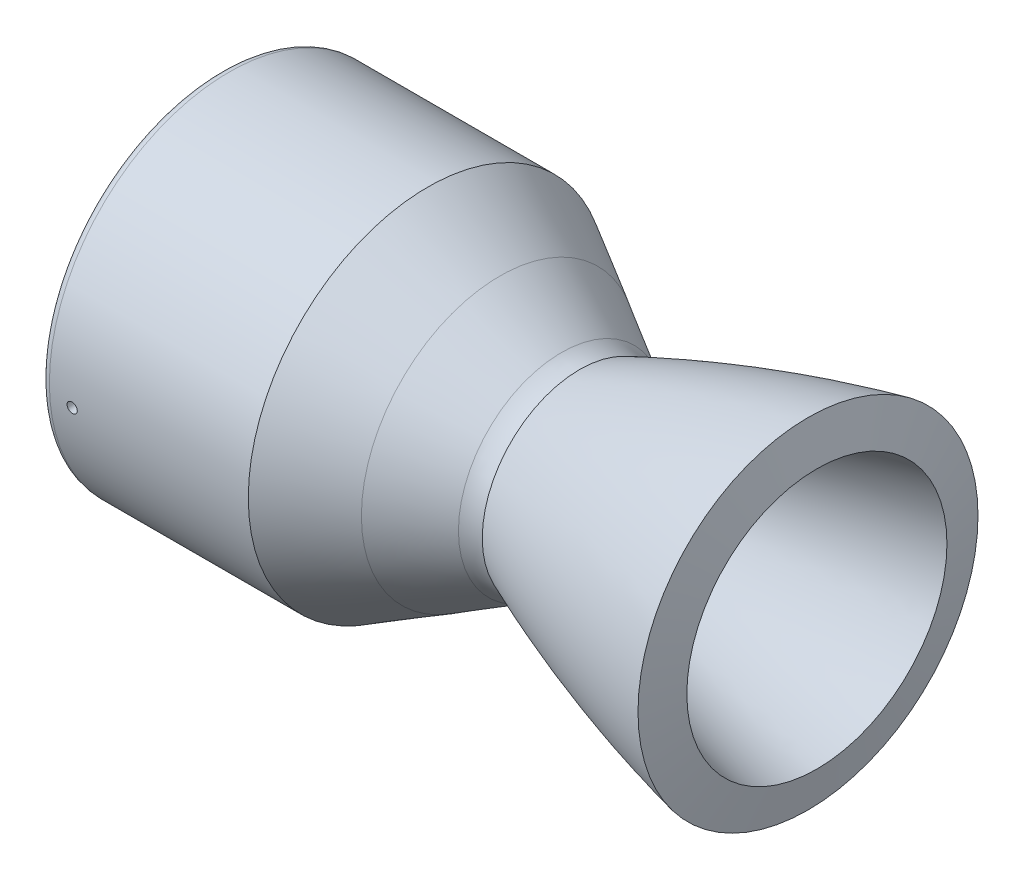
ISO-10303-21;
HEADER;
FILE_DESCRIPTION(('STEP AP214'),'2;1');
FILE_NAME('part.step','',(''),(''),'','','');
FILE_SCHEMA(('AUTOMOTIVE_DESIGN { 1 0 10303 214 1 1 1 1 }'));
ENDSEC;
DATA;
#1=APPLICATION_CONTEXT('core data for automotive mechanical design processes');
#2=APPLICATION_PROTOCOL_DEFINITION('international standard','automotive_design',2000,#1);
#3=PRODUCT_CONTEXT('',#1,'mechanical');
#4=PRODUCT('Part','Part','',(#3));
#5=PRODUCT_RELATED_PRODUCT_CATEGORY('part','',(#4));
#6=PRODUCT_DEFINITION_FORMATION('','',#4);
#7=PRODUCT_DEFINITION_CONTEXT('part definition',#1,'design');
#8=PRODUCT_DEFINITION('design','',#6,#7);
#9=PRODUCT_DEFINITION_SHAPE('','',#8);
#10=(LENGTH_UNIT() NAMED_UNIT(*) SI_UNIT(.MILLI.,.METRE.));
#11=(NAMED_UNIT(*) PLANE_ANGLE_UNIT() SI_UNIT($,.RADIAN.));
#12=(NAMED_UNIT(*) SI_UNIT($,.STERADIAN.) SOLID_ANGLE_UNIT());
#13=UNCERTAINTY_MEASURE_WITH_UNIT(LENGTH_MEASURE(1.E-05),#10,'distance_accuracy_value','');
#14=(GEOMETRIC_REPRESENTATION_CONTEXT(3) GLOBAL_UNCERTAINTY_ASSIGNED_CONTEXT((#13)) GLOBAL_UNIT_ASSIGNED_CONTEXT((#10,
#11,#12)) REPRESENTATION_CONTEXT('',''));
#15=CARTESIAN_POINT('',(0.,0.,0.));
#16=DIRECTION('',(0.,0.,1.));
#17=DIRECTION('',(1.,0.,0.));
#18=AXIS2_PLACEMENT_3D('',#15,#16,#17);
#19=CARTESIAN_POINT('',(2.54181884933777,17.9961231089638,0.));
#20=CARTESIAN_POINT('',(36.7084102,32.3929756,0.));
#21=CARTESIAN_POINT('',(72.4744296,40.360473,0.));
#22=B_SPLINE_CURVE_WITH_KNOTS('',2,(#19,#20,#21),.UNSPECIFIED.,.F.,.F.,(3,3),(0.,1.),.UNSPECIFIED.);
#23=CARTESIAN_POINT('',(-112.522,0.,0.));
#24=DIRECTION('',(-1.,0.,0.));
#25=AXIS1_PLACEMENT('',#23,#24);
#26=SURFACE_OF_REVOLUTION('',#22,#25);
#27=CARTESIAN_POINT('',(72.4744296,0.,0.));
#28=DIRECTION('',(-1.,0.,0.));
#29=DIRECTION('',(0.,0.,1.));
#30=AXIS2_PLACEMENT_3D('',#27,#28,#29);
#31=CIRCLE('',#30,40.360473);
#32=CARTESIAN_POINT('',(72.4744296,0.,40.360473));
#33=VERTEX_POINT('',#32);
#34=EDGE_CURVE('E79',#33,#33,#31,.T.);
#35=ORIENTED_EDGE('',*,*,#34,.F.);
#36=EDGE_LOOP('',(#35));
#37=FACE_BOUND('',#36,.T.);
#38=CARTESIAN_POINT('',(2.54181884933777,0.,0.));
#39=DIRECTION('',(-1.,0.,0.));
#40=DIRECTION('',(0.,0.,1.));
#41=AXIS2_PLACEMENT_3D('',#38,#39,#40);
#42=CIRCLE('',#41,17.9961231089638);
#43=CARTESIAN_POINT('',(2.54181884933777,0.,17.9961231089638));
#44=VERTEX_POINT('',#43);
#45=EDGE_CURVE('E121',#44,#44,#42,.T.);
#46=ORIENTED_EDGE('',*,*,#45,.T.);
#47=EDGE_LOOP('',(#46));
#48=FACE_BOUND('',#47,.T.);
#49=ADVANCED_FACE('F39',(#37,#48),#26,.T.);
#50=CARTESIAN_POINT('',(72.4744296,0.,0.));
#51=DIRECTION('',(-1.,0.,0.));
#52=DIRECTION('',(0.,0.,1.));
#53=AXIS2_PLACEMENT_3D('',#50,#51,#52);
#54=CONICAL_SURFACE('',#53,40.360473,1.3516080717549);
#55=CARTESIAN_POINT('',(69.7129749828024,0.,0.));
#56=DIRECTION('',(-1.,0.,0.));
#57=DIRECTION('',(0.,0.,1.));
#58=AXIS2_PLACEMENT_3D('',#55,#56,#57);
#59=CIRCLE('',#58,52.7566162872147);
#60=CARTESIAN_POINT('',(69.7129749828024,0.,52.7566162872147));
#61=VERTEX_POINT('',#60);
#62=EDGE_CURVE('E83',#61,#61,#59,.T.);
#63=ORIENTED_EDGE('',*,*,#62,.F.);
#64=EDGE_LOOP('',(#63));
#65=FACE_BOUND('',#64,.T.);
#66=ORIENTED_EDGE('',*,*,#34,.T.);
#67=EDGE_LOOP('',(#66));
#68=FACE_BOUND('',#67,.T.);
#69=ADVANCED_FACE('F142',(#65,#68),#54,.T.);
#70=CARTESIAN_POINT('',(69.7129749828024,52.7566162872147,0.));
#71=CARTESIAN_POINT('',(57.6343477080184,50.0658938355177,0.));
#72=CARTESIAN_POINT('',(39.7050398462939,45.2263831834167,0.));
#73=CARTESIAN_POINT('',(16.2272037398131,37.1845855209253,0.));
#74=CARTESIAN_POINT('',(4.59605992113903,32.6199854330453,0.));
#75=CARTESIAN_POINT('',(-1.15654760217802,30.2169193227736,0.));
#76=B_SPLINE_CURVE_WITH_KNOTS('',3,(#70,#71,#72,#73,#74,#75),.UNSPECIFIED.,.F.,.F.,(4,1,1,4),
(0.0175086981395631,0.508754349069782,0.754377174534891,1.),.UNSPECIFIED.);
#77=CARTESIAN_POINT('',(-112.522,0.,0.));
#78=DIRECTION('',(-1.,0.,0.));
#79=AXIS1_PLACEMENT('',#77,#78);
#80=SURFACE_OF_REVOLUTION('',#76,#79);
#81=CARTESIAN_POINT('',(-1.15654760217802,0.,0.));
#82=DIRECTION('',(-1.,0.,0.));
#83=DIRECTION('',(0.,0.,1.));
#84=AXIS2_PLACEMENT_3D('',#81,#82,#83);
#85=CIRCLE('',#84,30.2169193227736);
#86=CARTESIAN_POINT('',(-1.15654760217802,0.,30.2169193227736));
#87=VERTEX_POINT('',#86);
#88=EDGE_CURVE('E88',#87,#87,#85,.T.);
#89=ORIENTED_EDGE('',*,*,#88,.F.);
#90=EDGE_LOOP('',(#89));
#91=FACE_BOUND('',#90,.T.);
#92=ORIENTED_EDGE('',*,*,#62,.T.);
#93=EDGE_LOOP('',(#92));
#94=FACE_BOUND('',#93,.T.);
#95=ADVANCED_FACE('F137',(#91,#94),#80,.T.);
#96=CARTESIAN_POINT('',(-0.0623918207048905,0.,0.));
#97=DIRECTION('',(-1.,0.,0.));
#98=DIRECTION('',(0.,0.,1.));
#99=AXIS2_PLACEMENT_3D('',#96,#97,#98);
#100=TOROIDAL_SURFACE('',#99,43.6343806,13.462);
#101=CARTESIAN_POINT('',(-6.79339099490552,0.,0.));
#102=DIRECTION('',(-1.,0.,0.));
#103=DIRECTION('',(0.,0.,1.));
#104=AXIS2_PLACEMENT_3D('',#101,#102,#103);
#105=CIRCLE('',#104,31.9759461374784);
#106=CARTESIAN_POINT('',(-6.79339099490552,0.,31.9759461374784));
#107=VERTEX_POINT('',#106);
#108=EDGE_CURVE('E91',#107,#107,#105,.T.);
#109=ORIENTED_EDGE('',*,*,#108,.F.);
#110=EDGE_LOOP('',(#109));
#111=FACE_BOUND('',#110,.T.);
#112=ORIENTED_EDGE('',*,*,#88,.T.);
#113=EDGE_LOOP('',(#112));
#114=FACE_BOUND('',#113,.T.);
#115=ADVANCED_FACE('F141',(#111,#114),#100,.F.);
#116=CARTESIAN_POINT('',(-6.79339099490552,0.,0.));
#117=DIRECTION('',(-1.,0.,0.));
#118=DIRECTION('',(0.,0.,1.));
#119=AXIS2_PLACEMENT_3D('',#116,#117,#118);
#120=CONICAL_SURFACE('',#119,31.9759461374784,0.523598704765514);
#121=CARTESIAN_POINT('',(-25.8858890437624,0.,0.));
#122=DIRECTION('',(-1.,0.,0.));
#123=DIRECTION('',(0.,0.,1.));
#124=AXIS2_PLACEMENT_3D('',#121,#122,#123);
#125=CIRCLE('',#124,42.999003222322);
#126=CARTESIAN_POINT('',(-25.8858890437624,0.,42.999003222322));
#127=VERTEX_POINT('',#126);
#128=EDGE_CURVE('E94',#127,#127,#125,.T.);
#129=ORIENTED_EDGE('',*,*,#128,.F.);
#130=EDGE_LOOP('',(#129));
#131=FACE_BOUND('',#130,.T.);
#132=ORIENTED_EDGE('',*,*,#108,.T.);
#133=EDGE_LOOP('',(#132));
#134=FACE_BOUND('',#133,.T.);
#135=ADVANCED_FACE('F202',(#131,#134),#120,.T.);
#136=CARTESIAN_POINT('',(-25.8858890437624,0.,0.));
#137=DIRECTION('',(-1.,0.,0.));
#138=DIRECTION('',(0.,0.,1.));
#139=AXIS2_PLACEMENT_3D('',#136,#137,#138);
#140=CONICAL_SURFACE('',#139,42.999003222322,0.517278453908498);
#141=CARTESIAN_POINT('',(-48.2551035346729,0.,0.));
#142=DIRECTION('',(-1.,0.,0.));
#143=DIRECTION('',(0.,0.,1.));
#144=AXIS2_PLACEMENT_3D('',#141,#142,#143);
#145=CIRCLE('',#144,55.7260506);
#146=CARTESIAN_POINT('',(-48.2551035346729,0.,55.7260506));
#147=VERTEX_POINT('',#146);
#148=EDGE_CURVE('E97',#147,#147,#145,.T.);
#149=ORIENTED_EDGE('',*,*,#148,.F.);
#150=EDGE_LOOP('',(#149));
#151=FACE_BOUND('',#150,.T.);
#152=ORIENTED_EDGE('',*,*,#128,.T.);
#153=EDGE_LOOP('',(#152));
#154=FACE_BOUND('',#153,.T.);
#155=ADVANCED_FACE('F197',(#151,#154),#140,.T.);
#156=CARTESIAN_POINT('',(-112.522,0.,0.));
#157=DIRECTION('',(-1.,0.,0.));
#158=DIRECTION('',(0.,0.,1.));
#159=AXIS2_PLACEMENT_3D('',#156,#157,#158);
#160=CYLINDRICAL_SURFACE('',#159,55.7260506);
#161=CARTESIAN_POINT('',(-102.997,-4.75570963469849,55.5227515649593));
#162=CARTESIAN_POINT('',(-102.907848841245,-4.75570571091992,55.5227520944038));
#163=CARTESIAN_POINT('',(-102.818633499949,-4.74819910466635,55.5233964527416));
#164=CARTESIAN_POINT('',(-102.64266118605,-4.71835766251599,55.5259401725782));
#165=CARTESIAN_POINT('',(-102.555907281623,-4.69600510083654,55.5278410343048));
#166=CARTESIAN_POINT('',(-102.387432618566,-4.63710676169106,55.5327905362983));
#167=CARTESIAN_POINT('',(-102.305709425921,-4.60056791153285,55.5358386163449));
#168=CARTESIAN_POINT('',(-102.149598897755,-4.51433947223615,55.5429141912278));
#169=CARTESIAN_POINT('',(-102.075209774292,-4.46465309921547,55.5469414465209));
#170=CARTESIAN_POINT('',(-101.935824438661,-4.35350934806793,55.5557627192288));
#171=CARTESIAN_POINT('',(-101.870831600273,-4.29204776032168,55.5605570107564));
#172=CARTESIAN_POINT('',(-101.752112073007,-4.15909924195716,55.5706671175146));
#173=CARTESIAN_POINT('',(-101.698385832165,-4.08761191283598,55.5759829534732));
#174=CARTESIAN_POINT('',(-101.603719888269,-3.93662346556042,55.5868818372681));
#175=CARTESIAN_POINT('',(-101.562782122247,-3.8571211358072,55.5924649254368));
#176=CARTESIAN_POINT('',(-101.494867847942,-3.69236306340507,55.6036507900974));
#177=CARTESIAN_POINT('',(-101.467891286433,-3.607107342691,55.6092535665141));
#178=CARTESIAN_POINT('',(-101.428672201946,-3.43328366373305,55.6202558110541));
#179=CARTESIAN_POINT('',(-101.416425656275,-3.34471661661111,55.6256553342944));
#180=CARTESIAN_POINT('',(-101.407001849143,-3.1667622574629,55.6360699119356));
#181=CARTESIAN_POINT('',(-101.409824530807,-3.0773749485338,55.6410849677874));
#182=CARTESIAN_POINT('',(-101.430455644495,-2.9003450545727,55.6505936315528));
#183=CARTESIAN_POINT('',(-101.44825973025,-2.81270197106969,55.6550873902701));
#184=CARTESIAN_POINT('',(-101.498341537994,-2.64162315204813,55.6634699097027));
#185=CARTESIAN_POINT('',(-101.530619290167,-2.55818742530427,55.6673586691562));
#186=CARTESIAN_POINT('',(-101.60873716587,-2.39788197177976,55.6744943692619));
#187=CARTESIAN_POINT('',(-101.654579281449,-2.32101321155612,55.6777412155264));
#188=CARTESIAN_POINT('',(-101.758523103521,-2.17603979761463,55.6835957741661));
#189=CARTESIAN_POINT('',(-101.816624834791,-2.10793516161002,55.6862034852496));
#190=CARTESIAN_POINT('',(-101.943463197182,-1.98240401773155,55.6908138356517));
#191=CARTESIAN_POINT('',(-102.012203600474,-1.92498131333039,55.6928162596062));
#192=CARTESIAN_POINT('',(-102.15835470188,-1.82247946309779,55.696264891251));
#193=CARTESIAN_POINT('',(-102.235765401387,-1.77740031924852,55.697711098852));
#194=CARTESIAN_POINT('',(-102.397061805599,-1.70087104176956,55.7001007747853));
#195=CARTESIAN_POINT('',(-102.480947568371,-1.6694210303819,55.7010442386084));
#196=CARTESIAN_POINT('',(-102.65281190435,-1.6210492970047,55.7024730619283));
#197=CARTESIAN_POINT('',(-102.740790467477,-1.6041275392384,55.7029584225533));
#198=CARTESIAN_POINT('',(-102.918309858025,-1.58529963490116,55.7034974774281));
#199=CARTESIAN_POINT('',(-103.007850125344,-1.58338821155562,55.7035513233741));
#200=CARTESIAN_POINT('',(-103.185980287516,-1.59462174912932,55.7032308516674));
#201=CARTESIAN_POINT('',(-103.274570183357,-1.60776669438446,55.7028565344602));
#202=CARTESIAN_POINT('',(-103.44827012201,-1.64873366123519,55.701658936549));
#203=CARTESIAN_POINT('',(-103.533380730619,-1.67655328614688,55.7008357291574));
#204=CARTESIAN_POINT('',(-103.697723466042,-1.74607382200014,55.6986996629791));
#205=CARTESIAN_POINT('',(-103.776955582264,-1.78777475795527,55.6973868033099));
#206=CARTESIAN_POINT('',(-103.927316516112,-1.88388266856028,55.6942187764313));
#207=CARTESIAN_POINT('',(-103.998443060566,-1.93829319457518,55.6923634576091));
#208=CARTESIAN_POINT('',(-104.13055099069,-2.05826456754104,55.6880584663342));
#209=CARTESIAN_POINT('',(-104.191532352609,-2.12382544059534,55.6856087924899));
#210=CARTESIAN_POINT('',(-104.301636469136,-2.26425287417343,55.6800754670408));
#211=CARTESIAN_POINT('',(-104.35075582062,-2.33912209588437,55.676991633969));
#212=CARTESIAN_POINT('',(-104.435718316046,-2.49602164193481,55.6701782758783));
#213=CARTESIAN_POINT('',(-104.471561488336,-2.57805195098208,55.6664487522383));
#214=CARTESIAN_POINT('',(-104.528948205432,-2.74692776148564,55.658370820752));
#215=CARTESIAN_POINT('',(-104.550493956962,-2.83377251761648,55.6540225085381));
#216=CARTESIAN_POINT('',(-104.578681467065,-3.00981976214041,55.6447793321076));
#217=CARTESIAN_POINT('',(-104.585323234764,-3.09902224908984,55.6398844682257));
#218=CARTESIAN_POINT('',(-104.583513980907,-3.27721788421365,55.6296730201472));
#219=CARTESIAN_POINT('',(-104.575068324571,-3.36621109554007,55.6243565865069));
#220=CARTESIAN_POINT('',(-104.543334990671,-3.54149497398161,55.613471775757));
#221=CARTESIAN_POINT('',(-104.520047283674,-3.6277856357366,55.6079033981477));
#222=CARTESIAN_POINT('',(-104.459291581467,-3.79522023738959,55.596727106624));
#223=CARTESIAN_POINT('',(-104.421823345265,-3.87636408979175,55.5911191920392));
#224=CARTESIAN_POINT('',(-104.333772184838,-4.03120456899237,55.5801055911994));
#225=CARTESIAN_POINT('',(-104.283189738893,-4.104901467247,55.5746998975775));
#226=CARTESIAN_POINT('',(-104.170330844837,-4.2427860232008,55.5643435365902));
#227=CARTESIAN_POINT('',(-104.108051487024,-4.30697130768423,55.5593929829021));
#228=CARTESIAN_POINT('',(-103.973553110029,-4.42401193991381,55.5501961326695));
#229=CARTESIAN_POINT('',(-103.901331632541,-4.47686447721181,55.5459500108786));
#230=CARTESIAN_POINT('',(-103.748972400875,-4.5697533595135,55.5383853727452));
#231=CARTESIAN_POINT('',(-103.668829676044,-4.60978158947631,55.5350674439179));
#232=CARTESIAN_POINT('',(-103.502999604881,-4.67580700877157,55.5295475615793));
#233=CARTESIAN_POINT('',(-103.417319011371,-4.70182093853356,55.5273442767907));
#234=CARTESIAN_POINT('',(-103.275413927347,-4.7321850674311,55.5247626528832));
#235=CARTESIAN_POINT('',(-103.22011061444,-4.7409957329416,55.5240102151579));
#236=CARTESIAN_POINT('',(-103.10887996143,-4.75275924710956,55.5230045051185));
#237=CARTESIAN_POINT('',(-103.052952621493,-4.75571209732153,55.522751232672));
#238=CARTESIAN_POINT('',(-102.997,-4.75570963469849,55.5227515649593));
#239=B_SPLINE_CURVE_WITH_KNOTS('',3,(#161,#162,#163,#164,#165,#166,#167,#168,#169,#170,#171,
#172,#173,#174,#175,#176,#177,#178,#179,#180,#181,#182,#183,#184,#185,#186,#187,#188,#189,#190,
#191,#192,#193,#194,#195,#196,#197,#198,#199,#200,#201,#202,#203,#204,#205,#206,#207,#208,#209,
#210,#211,#212,#213,#214,#215,#216,#217,#218,#219,#220,#221,#222,#223,#224,#225,#226,#227,#228,
#229,#230,#231,#232,#233,#234,#235,#236,#237,#238),.UNSPECIFIED.,.T.,.F.,(4,2,2,2,2,2,2,2,2,2,2,
2,2,2,2,2,2,2,2,2,2,2,2,2,2,2,2,2,2,2,2,2,2,2,2,2,2,2,4),(0.,0.267249242578295,
0.534818150574558,0.802256565969308,1.06962962155423,1.33709844152109,1.6045778958468,
1.87209784488236,2.13961677405481,2.40706262858024,2.67450747368626,2.94187475685688,
3.2092425976148,3.47664972327275,3.74405738938113,4.01156008877694,4.2790628311292,
4.54656797270975,4.81407245553979,5.08148289489032,5.34889305603731,5.6162595569958,
5.88362653974067,6.15106832080692,6.41851072797238,6.68602977150038,6.95354824376627,
7.22102541647457,7.48850242540581,7.7558843361083,8.02326677709129,8.29065376236297,
8.55803099733316,8.82547483291899,9.09298491633701,9.36066394354954,9.62802250851031,
9.79575223733606,9.96348192165061),.UNSPECIFIED.);
#240=CARTESIAN_POINT('',(-102.997,-4.75570963469849,55.5227515649593));
#241=VERTEX_POINT('',#240);
#242=EDGE_CURVE('E124',#241,#241,#239,.T.);
#243=ORIENTED_EDGE('',*,*,#242,.F.);
#244=EDGE_LOOP('',(#243));
#245=FACE_BOUND('',#244,.T.);
#246=CARTESIAN_POINT('',(-109.982,0.,0.));
#247=DIRECTION('',(1.,0.,0.));
#248=DIRECTION('',(0.,0.,-1.));
#249=AXIS2_PLACEMENT_3D('',#246,#247,#248);
#250=CIRCLE('',#249,55.7260506);
#251=CARTESIAN_POINT('',(-109.982,-55.3207117417371,-6.70906609457612));
#252=VERTEX_POINT('',#251);
#253=CARTESIAN_POINT('',(-109.982,-55.724769890329,0.377804372177944));
#254=VERTEX_POINT('',#253);
#255=EDGE_CURVE('E11',#252,#254,#250,.T.);
#256=ORIENTED_EDGE('',*,*,#255,.T.);
#257=CARTESIAN_POINT('',(-109.982,-55.3207117417371,-6.70906609457612));
#258=CARTESIAN_POINT('',(-109.882234790992,-55.3077893231097,-6.81562196366975));
#259=CARTESIAN_POINT('',(-109.777933895461,-55.2950664805499,-6.91795175341006));
#260=CARTESIAN_POINT('',(-109.56104466591,-55.2702511089258,-7.11349180234265));
#261=CARTESIAN_POINT('',(-109.448456623014,-55.258158557745,-7.2067023816207));
#262=CARTESIAN_POINT('',(-109.215832313474,-55.2348402449228,-7.38329684678595));
#263=CARTESIAN_POINT('',(-109.095800073754,-55.2236140218936,-7.46668597599402));
#264=CARTESIAN_POINT('',(-108.849082216608,-55.2022380458977,-7.62311379080917));
#265=CARTESIAN_POINT('',(-108.722396699291,-55.1920882767411,-7.69615263209136));
#266=CARTESIAN_POINT('',(-108.463215126652,-55.1730613642016,-7.83139085134938));
#267=CARTESIAN_POINT('',(-108.330716958407,-55.1641846886839,-7.89358624613331));
#268=CARTESIAN_POINT('',(-108.060841393401,-55.147882840322,-8.00668480110182));
#269=CARTESIAN_POINT('',(-107.923462212959,-55.1404582046833,-8.05758378293207));
#270=CARTESIAN_POINT('',(-107.644935607693,-55.1272191720955,-8.14766807638908));
#271=CARTESIAN_POINT('',(-107.503790610381,-55.1214037640517,-8.18686074445168));
#272=CARTESIAN_POINT('',(-107.218603116805,-55.1114940822932,-8.25330635617029));
#273=CARTESIAN_POINT('',(-107.074559574279,-55.1074004421849,-8.28055490457487));
#274=CARTESIAN_POINT('',(-106.78510081735,-55.1010315586007,-8.32282962457329));
#275=CARTESIAN_POINT('',(-106.639691147001,-55.0987507907754,-8.33789293065237));
#276=CARTESIAN_POINT('',(-106.348050639712,-55.0960332912535,-8.35583113000385));
#277=CARTESIAN_POINT('',(-106.201819519588,-55.0955972402445,-8.35870152417882));
#278=CARTESIAN_POINT('',(-105.909666777569,-55.0965799422385,-8.35222154146333));
#279=CARTESIAN_POINT('',(-105.763745094853,-55.0979982886519,-8.34287384347545));
#280=CARTESIAN_POINT('',(-105.473167138409,-55.1026606868073,-8.31202403288611));
#281=CARTESIAN_POINT('',(-105.328511351909,-55.1059054126035,-8.29051743283769));
#282=CARTESIAN_POINT('',(-105.041944244689,-55.1141430203091,-8.23557664154237));
#283=CARTESIAN_POINT('',(-104.900026505217,-55.1191311015345,-8.20217520043128));
#284=CARTESIAN_POINT('',(-104.619482290532,-55.130757804503,-8.12365887024102));
#285=CARTESIAN_POINT('',(-104.480857045806,-55.1373970330102,-8.07853967484812));
#286=CARTESIAN_POINT('',(-104.207986413276,-55.1521882144771,-7.97693440663297));
#287=CARTESIAN_POINT('',(-104.073739207531,-55.1603395299048,-7.92045312349472));
#288=CARTESIAN_POINT('',(-103.810459026056,-55.1779973136329,-7.79648947037484));
#289=CARTESIAN_POINT('',(-103.68142800025,-55.1875042828032,-7.72900303301966));
#290=CARTESIAN_POINT('',(-103.429245593928,-55.2077080706145,-7.58334333628866));
#291=CARTESIAN_POINT('',(-103.306107975224,-55.2184074968618,-7.50514656715309));
#292=CARTESIAN_POINT('',(-103.066872282105,-55.2407704379077,-7.33873674819555));
#293=CARTESIAN_POINT('',(-102.950776824304,-55.2524343073008,-7.25052000986183));
#294=CARTESIAN_POINT('',(-102.614391639616,-55.2885353281038,-6.97177182985115));
#295=CARTESIAN_POINT('',(-102.405741527883,-55.3141034524291,-6.76699104224816));
#296=CARTESIAN_POINT('',(-102.02530437304,-55.3664177129562,-6.32472758025047));
#297=CARTESIAN_POINT('',(-101.8536464285,-55.3931675942595,-6.08713498130547));
#298=CARTESIAN_POINT('',(-101.552817059552,-55.4459126710676,-5.5863027242893));
#299=CARTESIAN_POINT('',(-101.42364506578,-55.4719078766819,-5.32306340997644));
#300=CARTESIAN_POINT('',(-101.211655822762,-55.5214537643547,-4.77864603591228));
#301=CARTESIAN_POINT('',(-101.128790496459,-55.5450069610076,-4.4974869203182));
#302=CARTESIAN_POINT('',(-101.011610751048,-55.5883967985782,-3.92494923036305));
#303=CARTESIAN_POINT('',(-100.977295101101,-55.6082335337052,-3.6335709152727));
#304=CARTESIAN_POINT('',(-100.958258881966,-55.6432829314625,-3.05006188253636));
#305=CARTESIAN_POINT('',(-100.973346537328,-55.6585132244616,-2.75793846237942));
#306=CARTESIAN_POINT('',(-101.052253996221,-55.6841394059338,-2.18013475746253));
#307=CARTESIAN_POINT('',(-101.11607360509,-55.6945353137179,-1.89445444696993));
#308=CARTESIAN_POINT('',(-101.290530082419,-55.7106848138657,-1.33784971085645));
#309=CARTESIAN_POINT('',(-101.401135230162,-55.7164415439354,-1.06691542760714));
#310=CARTESIAN_POINT('',(-101.666007594904,-55.7239702917559,-0.547231967800574));
#311=CARTESIAN_POINT('',(-101.820275809911,-55.7257422184176,-0.298483298512073));
#312=CARTESIAN_POINT('',(-102.168697318561,-55.7262856679868,0.170642285551011));
#313=CARTESIAN_POINT('',(-102.362990947731,-55.725046463712,0.390914811344613));
#314=CARTESIAN_POINT('',(-102.785839577635,-55.7207355549712,0.795901182900492));
#315=CARTESIAN_POINT('',(-103.014395161535,-55.7176638193115,0.980614423294664));
#316=CARTESIAN_POINT('',(-103.378030779475,-55.7126000510115,1.22706575986088));
#317=CARTESIAN_POINT('',(-103.502936667769,-55.7108327527109,1.30421662883008));
#318=CARTESIAN_POINT('',(-103.75879797472,-55.7072888138291,1.44770060852473));
#319=CARTESIAN_POINT('',(-103.889751133495,-55.7055121769542,1.51403771906829));
#320=CARTESIAN_POINT('',(-104.156834936681,-55.7020805261722,1.63543050361904));
#321=CARTESIAN_POINT('',(-104.29296746531,-55.7004255571816,1.69048202457064));
#322=CARTESIAN_POINT('',(-104.569353746117,-55.6973529085176,1.78885912050296));
#323=CARTESIAN_POINT('',(-104.709605933648,-55.695935140091,1.83218908509415));
#324=CARTESIAN_POINT('',(-104.992968969303,-55.6934325152471,1.90674595550766));
#325=CARTESIAN_POINT('',(-105.136072976745,-55.6923469452594,1.93799884171371));
#326=CARTESIAN_POINT('',(-105.424358692985,-55.6905740446215,1.98829376825136));
#327=CARTESIAN_POINT('',(-105.569539605241,-55.689886565279,2.00734036808343));
#328=CARTESIAN_POINT('',(-105.861032655366,-55.6889520084177,2.03310269267902));
#329=CARTESIAN_POINT('',(-106.007345089809,-55.6887050505805,2.03981506647576));
#330=CARTESIAN_POINT('',(-106.299959416614,-55.6886671903182,2.0408484347545));
#331=CARTESIAN_POINT('',(-106.44626129265,-55.6888761182766,2.035174037847));
#332=CARTESIAN_POINT('',(-106.737386202033,-55.6897353591404,2.01152427854855));
#333=CARTESIAN_POINT('',(-106.882212498823,-55.6903842332235,1.99358901315053));
#334=CARTESIAN_POINT('',(-107.169785826477,-55.6920813781085,1.94560078159616));
#335=CARTESIAN_POINT('',(-107.312533605413,-55.6931295013343,1.91555229265601));
#336=CARTESIAN_POINT('',(-107.595107820736,-55.6955600644451,1.84352987150661));
#337=CARTESIAN_POINT('',(-107.734931808328,-55.6969427732622,1.8015463414156));
#338=CARTESIAN_POINT('',(-108.010501248859,-55.6999515208848,1.70598890687004));
#339=CARTESIAN_POINT('',(-108.146248170277,-55.7015774707862,1.65241923394651));
#340=CARTESIAN_POINT('',(-108.4130559982,-55.7049662200237,1.533939937652));
#341=CARTESIAN_POINT('',(-108.544105911125,-55.7067293132297,1.46900556823162));
#342=CARTESIAN_POINT('',(-108.800234723128,-55.7102601014252,1.32837386170376));
#343=CARTESIAN_POINT('',(-108.925315847118,-55.7120277944369,1.25268057759372));
#344=CARTESIAN_POINT('',(-109.168500134817,-55.7154247325858,1.09118060652492));
#345=CARTESIAN_POINT('',(-109.286613213111,-55.7170541759556,1.00538883614535));
#346=CARTESIAN_POINT('',(-109.515189789468,-55.7200280586851,0.824246356351008));
#347=CARTESIAN_POINT('',(-109.625657620881,-55.7213726603994,0.728901138136861));
#348=CARTESIAN_POINT('',(-109.775033290647,-55.7229562293373,0.588646637447022));
#349=CARTESIAN_POINT('',(-109.817457705681,-55.7233774121529,0.547433354690079));
#350=CARTESIAN_POINT('',(-109.90082977468,-55.7241375316942,0.463642679398343));
#351=CARTESIAN_POINT('',(-109.94177923687,-55.724476572262,0.421067087003564));
#352=CARTESIAN_POINT('',(-109.982,-55.7247698903291,0.377804372177946));
#353=B_SPLINE_CURVE_WITH_KNOTS('',3,(#257,#258,#259,#260,#261,#262,#263,#264,#265,#266,#267,
#268,#269,#270,#271,#272,#273,#274,#275,#276,#277,#278,#279,#280,#281,#282,#283,#284,#285,#286,
#287,#288,#289,#290,#291,#292,#293,#294,#295,#296,#297,#298,#299,#300,#301,#302,#303,#304,#305,
#306,#307,#308,#309,#310,#311,#312,#313,#314,#315,#316,#317,#318,#319,#320,#321,#322,#323,#324,
#325,#326,#327,#328,#329,#330,#331,#332,#333,#334,#335,#336,#337,#338,#339,#340,#341,#342,#343,
#344,#345,#346,#347,#348,#349,#350,#351,#352),.UNSPECIFIED.,.F.,.F.,(4,2,2,2,2,2,2,2,2,2,2,2,2,
2,2,2,2,2,2,2,2,2,2,2,2,2,2,2,2,2,2,2,2,2,2,2,2,2,2,2,2,2,2,2,2,2,2,4),(0.,0.439489412732299,
0.878963393775341,1.31820168156812,1.75743336222795,2.19682605024438,2.63638099240662,
3.07565912719134,3.51509877411527,3.95319413096825,4.39145112784501,4.82961204991182,
5.26793478828809,5.70505990393691,6.14234589240776,6.57944792796514,7.01671187887976,
7.45495150730972,7.89335298484985,8.76925835715471,9.64817273936777,10.527075342585,
11.4050637376987,12.2830298735119,13.1575919365992,14.0321505062216,14.9061170709068,
15.7801036135084,16.6572083033848,17.5343279239397,17.9743657745673,18.4142404918332,
18.8542767919498,19.2941480738469,19.7330677594908,20.1718233966505,20.6106982174787,
21.049409778777,21.4866934324425,21.9238156079513,22.3612903061752,22.7986054973776,
23.2368850440277,23.6749999215539,24.1124755895763,24.5497012290955,24.7271194001182,
24.9043120993559),.UNSPECIFIED.);
#354=EDGE_CURVE('E56',#252,#254,#353,.T.);
#355=ORIENTED_EDGE('',*,*,#354,.F.);
#356=EDGE_LOOP('',(#256,#355));
#357=FACE_BOUND('',#356,.T.);
#358=ORIENTED_EDGE('',*,*,#148,.T.);
#359=EDGE_LOOP('',(#358));
#360=FACE_BOUND('',#359,.T.);
#361=ADVANCED_FACE('F67',(#245,#357,#360),#160,.T.);
#362=CARTESIAN_POINT('',(-112.522,43.0260506,0.));
#363=DIRECTION('',(1.,0.,0.));
#364=DIRECTION('',(0.,0.,-1.));
#365=AXIS2_PLACEMENT_3D('',#362,#363,#364);
#366=PLANE('',#365);
#367=CARTESIAN_POINT('',(-112.522,0.,0.));
#368=DIRECTION('',(1.,0.,0.));
#369=DIRECTION('',(0.,0.,-1.));
#370=AXIS2_PLACEMENT_3D('',#367,#368,#369);
#371=CIRCLE('',#370,53.1860506);
#372=CARTESIAN_POINT('',(-112.522,0.,-53.1860506));
#373=VERTEX_POINT('',#372);
#374=EDGE_CURVE('E48',#373,#373,#371,.F.);
#375=ORIENTED_EDGE('',*,*,#374,.T.);
#376=EDGE_LOOP('',(#375));
#377=FACE_BOUND('',#376,.T.);
#378=CARTESIAN_POINT('',(-112.522,0.,0.));
#379=DIRECTION('',(-1.,0.,0.));
#380=DIRECTION('',(0.,0.,1.));
#381=AXIS2_PLACEMENT_3D('',#378,#379,#380);
#382=CIRCLE('',#381,43.0260506);
#383=CARTESIAN_POINT('',(-112.522,0.,43.0260506));
#384=VERTEX_POINT('',#383);
#385=EDGE_CURVE('E101',#384,#384,#382,.T.);
#386=ORIENTED_EDGE('',*,*,#385,.F.);
#387=EDGE_LOOP('',(#386));
#388=FACE_BOUND('',#387,.T.);
#389=ADVANCED_FACE('F187',(#377,#388),#366,.F.);
#390=CARTESIAN_POINT('',(-112.522,0.,0.));
#391=DIRECTION('',(-1.,0.,0.));
#392=DIRECTION('',(0.,0.,1.));
#393=AXIS2_PLACEMENT_3D('',#390,#391,#392);
#394=CYLINDRICAL_SURFACE('',#393,43.0260506);
#395=CARTESIAN_POINT('',(-106.172,-42.34416782135,-7.62971046312405));
#396=CARTESIAN_POINT('',(-106.317715241806,-42.34416718495,-7.62971205970418));
#397=CARTESIAN_POINT('',(-106.463406401481,-42.3452621384531,-7.6236440598921));
#398=CARTESIAN_POINT('',(-106.753793676838,-42.3496168014059,-7.59941746869215));
#399=CARTESIAN_POINT('',(-106.898489556976,-42.3528770066056,-7.58125610843946));
#400=CARTESIAN_POINT('',(-107.185912811994,-42.3614950035313,-7.53295230148388));
#401=CARTESIAN_POINT('',(-107.328638617717,-42.3668543775122,-7.50280081692499));
#402=CARTESIAN_POINT('',(-107.611051488309,-42.3795555263984,-7.43072285752887));
#403=CARTESIAN_POINT('',(-107.75073741984,-42.3868980274279,-7.38879206945971));
#404=CARTESIAN_POINT('',(-108.025884140612,-42.4033967694492,-7.29351119675331));
#405=CARTESIAN_POINT('',(-108.161349174055,-42.4125511156815,-7.2401730368606));
#406=CARTESIAN_POINT('',(-108.42730599006,-42.4324862748858,-7.1224085949117));
#407=CARTESIAN_POINT('',(-108.55779591924,-42.443267686716,-7.0579782290214));
#408=CARTESIAN_POINT('',(-108.812769879898,-42.4662207413176,-6.91853406271527));
#409=CARTESIAN_POINT('',(-108.937257184286,-42.4783916140141,-6.84352611929402));
#410=CARTESIAN_POINT('',(-109.179485814425,-42.5038808424606,-6.68339108563703));
#411=CARTESIAN_POINT('',(-109.297224619464,-42.5171996223882,-6.5982602503161));
#412=CARTESIAN_POINT('',(-109.525586126699,-42.5447691211878,-6.41809847746575));
#413=CARTESIAN_POINT('',(-109.636175855865,-42.559023620908,-6.3230263217328));
#414=CARTESIAN_POINT('',(-109.848949072129,-42.5881311209353,-6.12390744944518));
#415=CARTESIAN_POINT('',(-109.951129435398,-42.6029843406238,-6.01985742701908));
#416=CARTESIAN_POINT('',(-110.146293146983,-42.6329872430817,-5.80356294045786));
#417=CARTESIAN_POINT('',(-110.23927941596,-42.6481368298612,-5.69132109841563));
#418=CARTESIAN_POINT('',(-110.415471029291,-42.6784523654431,-5.45934243483523));
#419=CARTESIAN_POINT('',(-110.498672752911,-42.6936183182196,-5.3396028637513));
#420=CARTESIAN_POINT('',(-110.654879008729,-42.7237201505011,-5.0931537203679));
#421=CARTESIAN_POINT('',(-110.727855030817,-42.7386552873573,-4.96642598172953));
#422=CARTESIAN_POINT('',(-110.862838302848,-42.7679891242277,-4.7071401865096));
#423=CARTESIAN_POINT('',(-110.92484147363,-42.782387623183,-4.57457998447915));
#424=CARTESIAN_POINT('',(-111.037371516924,-42.810389503715,-4.30464434420399));
#425=CARTESIAN_POINT('',(-111.087902938674,-42.823993198884,-4.16727083975782));
#426=CARTESIAN_POINT('',(-111.177163084011,-42.8501950449334,-3.88863319072394));
#427=CARTESIAN_POINT('',(-111.215887470574,-42.8627928250644,-3.74736763721323));
#428=CARTESIAN_POINT('',(-111.313502719474,-42.8986531926481,-3.320738122933));
#429=CARTESIAN_POINT('',(-111.354516566732,-42.9201551310821,-3.03090265225055));
#430=CARTESIAN_POINT('',(-111.387213076011,-42.9573328559067,-2.44825585689516));
#431=CARTESIAN_POINT('',(-111.378897563893,-42.973008857914,-2.15544464276599));
#432=CARTESIAN_POINT('',(-111.313427406089,-42.998126230324,-1.57658633767431));
#433=CARTESIAN_POINT('',(-111.25652845418,-43.0075997837382,-1.29051187673497));
#434=CARTESIAN_POINT('',(-111.095888725181,-43.0207371613123,-0.731705573668535));
#435=CARTESIAN_POINT('',(-110.992147105085,-43.0244008809102,-0.458973971764341));
#436=CARTESIAN_POINT('',(-110.740498053796,-43.0268037426072,0.0661577655593349));
#437=CARTESIAN_POINT('',(-110.592479507891,-43.0255303976284,0.318504697114119));
#438=CARTESIAN_POINT('',(-110.256557873406,-43.0193656757345,0.795039509783318));
#439=CARTESIAN_POINT('',(-110.068653069949,-43.0144741432358,1.01922617951067));
#440=CARTESIAN_POINT('',(-109.656859635729,-43.0026366457837,1.43450066525248));
#441=CARTESIAN_POINT('',(-109.432748172237,-42.9956777190093,1.6253672165123));
#442=CARTESIAN_POINT('',(-108.955669739391,-42.9814160446965,1.96677266882171));
#443=CARTESIAN_POINT('',(-108.702702689501,-42.9741132961987,2.1173114573129));
#444=CARTESIAN_POINT('',(-108.174901145416,-42.9607151525572,2.37372188531233));
#445=CARTESIAN_POINT('',(-107.900058326541,-42.9546202201489,2.47957642299646));
#446=CARTESIAN_POINT('',(-107.336406412403,-42.9448537867635,2.64336086101126));
#447=CARTESIAN_POINT('',(-107.047597947285,-42.9411821765529,2.70129292152385));
#448=CARTESIAN_POINT('',(-106.46616846326,-42.9369817896468,2.76726031757851));
#449=CARTESIAN_POINT('',(-106.173583105746,-42.9364332843067,2.7756088863753));
#450=CARTESIAN_POINT('',(-105.59119097505,-42.9385290286965,2.74299318749178));
#451=CARTESIAN_POINT('',(-105.30138414656,-42.9411732147409,2.70202990344876));
#452=CARTESIAN_POINT('',(-104.733704976769,-42.9491416651527,2.57224076996352));
#453=CARTESIAN_POINT('',(-104.455797955381,-42.9544574711567,2.48356591347469));
#454=CARTESIAN_POINT('',(-103.918723439841,-42.96674189163,2.26107538997413));
#455=CARTESIAN_POINT('',(-103.659556565237,-42.9737105607103,2.12725823138889));
#456=CARTESIAN_POINT('',(-103.165907492274,-42.9879226076593,1.81757936485818));
#457=CARTESIAN_POINT('',(-102.931554015596,-42.9951671759626,1.64151254286949));
#458=CARTESIAN_POINT('',(-102.495496257534,-43.0082491544272,1.25270591543586));
#459=CARTESIAN_POINT('',(-102.293793165605,-43.0140865133277,1.03996477452587));
#460=CARTESIAN_POINT('',(-101.927670278071,-43.0227165871537,0.582574492687011));
#461=CARTESIAN_POINT('',(-101.763454979993,-43.0254929045597,0.337761290235239));
#462=CARTESIAN_POINT('',(-101.478384229345,-43.0264561620002,-0.175950246925344));
#463=CARTESIAN_POINT('',(-101.357527949974,-43.024643189552,-0.444848122247703));
#464=CARTESIAN_POINT('',(-101.162939774445,-43.0153560696179,-0.998290423509374));
#465=CARTESIAN_POINT('',(-101.089088781123,-43.0078963352739,-1.28279330619665));
#466=CARTESIAN_POINT('',(-100.990239793627,-42.9867916887121,-1.86009590875752));
#467=CARTESIAN_POINT('',(-100.96523974143,-42.9731470370861,-2.15289527858422));
#468=CARTESIAN_POINT('',(-100.964882979781,-42.9482373496333,-2.59063093014497));
#469=CARTESIAN_POINT('',(-100.970889287317,-42.9392237074212,-2.73591160752627));
#470=CARTESIAN_POINT('',(-100.995063662755,-42.91980027048,-3.02534889270802));
#471=CARTESIAN_POINT('',(-101.013227203401,-42.9093909966261,-3.16950589874567));
#472=CARTESIAN_POINT('',(-101.061595995037,-42.8872895055645,-3.45572887163791));
#473=CARTESIAN_POINT('',(-101.091805624811,-42.8755968229558,-3.59779405861768));
#474=CARTESIAN_POINT('',(-101.164027956722,-42.8510942272203,-3.87874006683008));
#475=CARTESIAN_POINT('',(-101.206036360378,-42.8382847221394,-4.01762202786908));
#476=CARTESIAN_POINT('',(-101.301557399358,-42.8117366175738,-4.29128677185654));
#477=CARTESIAN_POINT('',(-101.355070612325,-42.7979979714616,-4.42606934859114));
#478=CARTESIAN_POINT('',(-101.473192009736,-42.7698198596037,-4.69054584379521));
#479=CARTESIAN_POINT('',(-101.537796161177,-42.7553806499685,-4.82024159100495));
#480=CARTESIAN_POINT('',(-101.677677842299,-42.726038639636,-5.07375038445913));
#481=CARTESIAN_POINT('',(-101.752959253556,-42.7111356718904,-5.19756126938979));
#482=CARTESIAN_POINT('',(-101.913617435616,-42.6811432345755,-5.43836013385029));
#483=CARTESIAN_POINT('',(-101.998990567429,-42.6660538339794,-5.55535055019976));
#484=CARTESIAN_POINT('',(-102.179845784086,-42.6358645140176,-5.78249967260985));
#485=CARTESIAN_POINT('',(-102.275390074873,-42.6207651659707,-5.89260893244466));
#486=CARTESIAN_POINT('',(-102.475417767171,-42.590952170341,-6.1043635828148));
#487=CARTESIAN_POINT('',(-102.579897911661,-42.576238384758,-6.20601203079255));
#488=CARTESIAN_POINT('',(-102.797164546693,-42.5474732182359,-6.40025005905953));
#489=CARTESIAN_POINT('',(-102.909956027416,-42.5334222436935,-6.49283411806684));
#490=CARTESIAN_POINT('',(-103.142959953588,-42.5062819067798,-6.66820075520416));
#491=CARTESIAN_POINT('',(-103.263169643284,-42.4931921912257,-6.75098694014511));
#492=CARTESIAN_POINT('',(-103.510705206496,-42.4681889242743,-6.90653260059586));
#493=CARTESIAN_POINT('',(-103.638057656759,-42.4562802943309,-6.97925058325401));
#494=CARTESIAN_POINT('',(-103.898488858006,-42.4339555983754,-7.11372536282814));
#495=CARTESIAN_POINT('',(-104.031565486391,-42.4235389852041,-7.17548617999865));
#496=CARTESIAN_POINT('',(-104.302442285,-42.4044248430262,-7.28759349505261));
#497=CARTESIAN_POINT('',(-104.440238635409,-42.3957259606621,-7.33794898354853));
#498=CARTESIAN_POINT('',(-104.719622800052,-42.3802283214935,-7.42693152694425));
#499=CARTESIAN_POINT('',(-104.861209704281,-42.3734291130343,-7.46556136985018));
#500=CARTESIAN_POINT('',(-105.195456817261,-42.3599312637977,-7.54183358750894));
#501=CARTESIAN_POINT('',(-105.389246507197,-42.3540389406018,-7.57475460777592));
#502=CARTESIAN_POINT('',(-105.779372043514,-42.3461576615609,-7.61869189424181));
#503=CARTESIAN_POINT('',(-105.975707872224,-42.3441686786407,-7.62970831238055));
#504=CARTESIAN_POINT('',(-106.172,-42.34416782135,-7.62971046312405));
#505=B_SPLINE_CURVE_WITH_KNOTS('',3,(#395,#396,#397,#398,#399,#400,#401,#402,#403,#404,#405,
#406,#407,#408,#409,#410,#411,#412,#413,#414,#415,#416,#417,#418,#419,#420,#421,#422,#423,#424,
#425,#426,#427,#428,#429,#430,#431,#432,#433,#434,#435,#436,#437,#438,#439,#440,#441,#442,#443,
#444,#445,#446,#447,#448,#449,#450,#451,#452,#453,#454,#455,#456,#457,#458,#459,#460,#461,#462,
#463,#464,#465,#466,#467,#468,#469,#470,#471,#472,#473,#474,#475,#476,#477,#478,#479,#480,#481,
#482,#483,#484,#485,#486,#487,#488,#489,#490,#491,#492,#493,#494,#495,#496,#497,#498,#499,#500,
#501,#502,#503,#504),.UNSPECIFIED.,.T.,.F.,(4,2,2,2,2,2,2,2,2,2,2,2,2,2,2,2,2,2,2,2,2,2,2,2,2,2,
2,2,2,2,2,2,2,2,2,2,2,2,2,2,2,2,2,2,2,2,2,2,2,2,2,2,2,2,4),(0.,0.4369739468747,
0.874047976600369,1.31145208819517,1.74901657345146,2.18612586524829,2.62339643374238,
3.06042582150673,3.49761739954242,3.93669948225806,4.3759439414801,4.81504841583328,
5.25431487123533,5.69478265532056,6.13541384096551,6.57586998345945,7.01648772230857,
7.89244294560463,8.76836574675395,9.63970679750354,10.5110635299823,11.3846255786622,
12.2582251930305,13.1374219022014,14.0166210652634,14.8961564162799,15.77565211868,
16.6495858322707,17.523502113551,18.394668838165,19.2658643503337,20.1413781079356,
21.016923753385,21.8971371094543,22.7773336800758,23.6552911269758,24.533211585933,
24.9698383226769,25.4063025535579,25.8429255851398,26.2793897539191,26.7158758422336,
27.1522035457894,27.588690278958,28.0250200960229,28.4641911370256,28.9032027816288,
29.3424801937607,29.7815953919869,30.2224695747055,30.6631816618002,31.1035451250525,
31.5438038009405,32.1324528655611,32.721097847042),.UNSPECIFIED.);
#506=CARTESIAN_POINT('',(-106.172,-42.34416782135,-7.62971046312405));
#507=VERTEX_POINT('',#506);
#508=EDGE_CURVE('E64',#507,#507,#505,.T.);
#509=ORIENTED_EDGE('',*,*,#508,.F.);
#510=EDGE_LOOP('',(#509));
#511=FACE_BOUND('',#510,.T.);
#512=CARTESIAN_POINT('',(-102.997,-4.03241253912598,42.8366744664903));
#513=CARTESIAN_POINT('',(-103.086138004593,-4.0324086251098,42.8366750850871));
#514=CARTESIAN_POINT('',(-103.175339870197,-4.02490785791984,42.8373829716877));
#515=CARTESIAN_POINT('',(-103.351284701345,-3.99508983226167,42.8401739381565));
#516=CARTESIAN_POINT('',(-103.438024613039,-3.97275494481563,42.8422586542425));
#517=CARTESIAN_POINT('',(-103.606471218947,-3.91390345284737,42.8476750617918));
#518=CARTESIAN_POINT('',(-103.688180382125,-3.87739387022994,42.8510061358009));
#519=CARTESIAN_POINT('',(-103.844265632232,-3.79123365768723,42.8587148576695));
#520=CARTESIAN_POINT('',(-103.918643486217,-3.74158620504735,42.8630922524604));
#521=CARTESIAN_POINT('',(-104.058023331467,-3.63051710893901,42.8726425006399));
#522=CARTESIAN_POINT('',(-104.12302033299,-3.56908923953818,42.8778157743622));
#523=CARTESIAN_POINT('',(-104.241751206252,-3.43620660324249,42.888669236376));
#524=CARTESIAN_POINT('',(-104.29548462625,-3.36475143438148,42.8943494449858));
#525=CARTESIAN_POINT('',(-104.390173635144,-3.21381280969144,42.9059221945458));
#526=CARTESIAN_POINT('',(-104.431125811817,-3.13432721745585,42.91181479173));
#527=CARTESIAN_POINT('',(-104.499067808635,-2.9695926076274,42.9235292321954));
#528=CARTESIAN_POINT('',(-104.526057699067,-2.88434361905003,42.9293510758326));
#529=CARTESIAN_POINT('',(-104.565297101105,-2.71053898843658,42.9406751821631));
#530=CARTESIAN_POINT('',(-104.577553377534,-2.62198488319036,42.9461775904174));
#531=CARTESIAN_POINT('',(-104.586998497706,-2.44404704253988,42.9566712649178));
#532=CARTESIAN_POINT('',(-104.584187418426,-2.3546633113765,42.9616625337753));
#533=CARTESIAN_POINT('',(-104.563583290273,-2.17764974751601,42.970998656664));
#534=CARTESIAN_POINT('',(-104.545797533808,-2.09001908236733,42.975343824124));
#535=CARTESIAN_POINT('',(-104.495760214032,-1.91895590713529,42.9833220593666));
#536=CARTESIAN_POINT('',(-104.463508610551,-1.83552340871019,42.9869551251717));
#537=CARTESIAN_POINT('',(-104.385446748569,-1.67520681844736,42.9935013414655));
#538=CARTESIAN_POINT('',(-104.339633153585,-1.59832434402907,42.9964143144748));
#539=CARTESIAN_POINT('',(-104.235750249453,-1.45331502412997,43.0015601855437));
#540=CARTESIAN_POINT('',(-104.177680895407,-1.38518821072601,43.0037930811117));
#541=CARTESIAN_POINT('',(-104.050893588405,-1.2595894828841,43.0076554120935));
#542=CARTESIAN_POINT('',(-103.98216930895,-1.20212394353468,43.0092844870197));
#543=CARTESIAN_POINT('',(-103.836045267927,-1.09953603990325,43.0120296290975));
#544=CARTESIAN_POINT('',(-103.758645504725,-1.05441367794702,43.0131456961525));
#545=CARTESIAN_POINT('',(-103.597363923977,-0.977800628882931,43.0149556774475));
#546=CARTESIAN_POINT('',(-103.513482003474,-0.946310158346873,43.0156495849808));
#547=CARTESIAN_POINT('',(-103.341618870195,-0.8978642343604,43.0166881826039));
#548=CARTESIAN_POINT('',(-103.253637674251,-0.880908721237662,43.0170328741275));
#549=CARTESIAN_POINT('',(-103.076129030015,-0.862024860227259,43.0174154792112));
#550=CARTESIAN_POINT('',(-102.986602524088,-0.860087657225549,43.0174535735481));
#551=CARTESIAN_POINT('',(-102.808495772815,-0.871272668034016,43.0172284585929));
#552=CARTESIAN_POINT('',(-102.719915525787,-0.884394855081034,43.0169652498363));
#553=CARTESIAN_POINT('',(-102.546240507945,-0.92531649211925,43.0161043558525));
#554=CARTESIAN_POINT('',(-102.461144786544,-0.953111910089433,43.0155067625073));
#555=CARTESIAN_POINT('',(-102.296825161223,-1.02258218327066,43.0139111931823));
#556=CARTESIAN_POINT('',(-102.217601275536,-1.06425708157562,43.0129132159593));
#557=CARTESIAN_POINT('',(-102.067233442354,-1.16031950570969,43.0104288484747));
#558=CARTESIAN_POINT('',(-101.996093302085,-1.21471298507596,43.0089422293484));
#559=CARTESIAN_POINT('',(-101.863950626578,-1.33465205919363,43.0053871513573));
#560=CARTESIAN_POINT('',(-101.802948128415,-1.40019769472855,43.0033186903646));
#561=CARTESIAN_POINT('',(-101.692782774794,-1.54061041563335,42.9985171539076));
#562=CARTESIAN_POINT('',(-101.643625629294,-1.6154819702146,42.995783759188));
#563=CARTESIAN_POINT('',(-101.558585401619,-1.7723910438821,42.9896012627921));
#564=CARTESIAN_POINT('',(-101.52270228146,-1.85442854246093,42.986152163164));
#565=CARTESIAN_POINT('',(-101.465238707405,-2.02331344568914,42.9785338306317));
#566=CARTESIAN_POINT('',(-101.443654568018,-2.11015960467171,42.9743647836399));
#567=CARTESIAN_POINT('',(-101.415389570325,-2.28621052538645,42.9653585729948));
#568=CARTESIAN_POINT('',(-101.408708678499,-2.37541528181346,42.9605214108442));
#569=CARTESIAN_POINT('',(-101.410440235507,-2.55359319485944,42.9502986083735));
#570=CARTESIAN_POINT('',(-101.418843704064,-2.64256645771707,42.9449132961877));
#571=CARTESIAN_POINT('',(-101.450486933006,-2.81781044147057,42.9337709336852));
#572=CARTESIAN_POINT('',(-101.473726722426,-2.90408115707721,42.928013882641));
#573=CARTESIAN_POINT('',(-101.534381372968,-3.07147783696833,42.9163616794417));
#574=CARTESIAN_POINT('',(-101.571796443592,-3.15260372519459,42.9104665252468));
#575=CARTESIAN_POINT('',(-101.659737292463,-3.30741432916234,42.8988120387648));
#576=CARTESIAN_POINT('',(-101.710262617308,-3.38109930211656,42.8930527017882));
#577=CARTESIAN_POINT('',(-101.823019220912,-3.51898693147559,42.8819607398562));
#578=CARTESIAN_POINT('',(-101.885256202972,-3.58318494064476,42.8766283246127));
#579=CARTESIAN_POINT('',(-102.019676107016,-3.70025952663393,42.8666837039825));
#580=CARTESIAN_POINT('',(-102.091861483354,-3.75313330142036,42.8620716769227));
#581=CARTESIAN_POINT('',(-102.244165506487,-3.84607967437562,42.8538316496803));
#582=CARTESIAN_POINT('',(-102.324289963076,-3.88614280576505,42.8502043775072));
#583=CARTESIAN_POINT('',(-102.490095294656,-3.95224500491693,42.8441583163401));
#584=CARTESIAN_POINT('',(-102.575769425137,-3.9783007504042,42.8417380904405));
#585=CARTESIAN_POINT('',(-102.71781851662,-4.00876843002204,42.8388951212798));
#586=CARTESIAN_POINT('',(-102.773272000064,-4.0176238251104,42.8380644390032));
#587=CARTESIAN_POINT('',(-102.884808554992,-4.02944711018041,42.8369539170435));
#588=CARTESIAN_POINT('',(-102.94089162619,-4.03241500282352,42.8366740771114));
#589=CARTESIAN_POINT('',(-102.997,-4.03241253912598,42.8366744664903));
#590=B_SPLINE_CURVE_WITH_KNOTS('',3,(#512,#513,#514,#515,#516,#517,#518,#519,#520,#521,#522,
#523,#524,#525,#526,#527,#528,#529,#530,#531,#532,#533,#534,#535,#536,#537,#538,#539,#540,#541,
#542,#543,#544,#545,#546,#547,#548,#549,#550,#551,#552,#553,#554,#555,#556,#557,#558,#559,#560,
#561,#562,#563,#564,#565,#566,#567,#568,#569,#570,#571,#572,#573,#574,#575,#576,#577,#578,#579,
#580,#581,#582,#583,#584,#585,#586,#587,#588,#589),.UNSPECIFIED.,.T.,.F.,(4,2,2,2,2,2,2,2,2,2,2,
2,2,2,2,2,2,2,2,2,2,2,2,2,2,2,2,2,2,2,2,2,2,2,2,2,2,2,4),(0.,0.267209206823899,
0.534736536603716,0.802131506611865,1.06946186836075,1.33693390510276,1.60441666710906,
1.87197077831569,2.13952354263683,2.40695341522275,2.67438192151301,2.94168027000768,
3.20897936074639,3.47634426638352,3.74371015149841,4.01123540085094,4.27876070061229,
4.54629025043026,4.81381870191781,5.08118940095278,5.3485596248242,5.61585641690377,
5.88315403891158,6.15057703366367,6.418001006405,6.6855536319919,6.95310549192445,
7.22058836481648,7.48807063611495,7.75539371815922,8.02271732335568,8.29004487959315,
8.55736319185974,8.82481202030512,9.0923269492034,9.36003911123217,9.62743181506394,
9.79562809573986,9.96382430038209),.UNSPECIFIED.);
#591=CARTESIAN_POINT('',(-102.997,-4.03241253912598,42.8366744664903));
#592=VERTEX_POINT('',#591);
#593=EDGE_CURVE('E348',#592,#592,#590,.T.);
#594=ORIENTED_EDGE('',*,*,#593,.F.);
#595=EDGE_LOOP('',(#594));
#596=FACE_BOUND('',#595,.T.);
#597=CARTESIAN_POINT('',(-73.3838832164237,0.,0.));
#598=DIRECTION('',(-1.,0.,0.));
#599=DIRECTION('',(0.,0.,1.));
#600=AXIS2_PLACEMENT_3D('',#597,#598,#599);
#601=CIRCLE('',#600,43.0260506);
#602=CARTESIAN_POINT('',(-73.3838832164237,0.,43.0260506));
#603=VERTEX_POINT('',#602);
#604=EDGE_CURVE('E104',#603,#603,#601,.T.);
#605=ORIENTED_EDGE('',*,*,#604,.F.);
#606=EDGE_LOOP('',(#605));
#607=FACE_BOUND('',#606,.T.);
#608=ORIENTED_EDGE('',*,*,#385,.T.);
#609=EDGE_LOOP('',(#608));
#610=FACE_BOUND('',#609,.T.);
#611=ADVANCED_FACE('F181',(#511,#596,#607,#610),#394,.F.);
#612=CARTESIAN_POINT('',(-73.3838832164234,0.,0.));
#613=DIRECTION('',(-1.,0.,0.));
#614=DIRECTION('',(0.,0.,1.));
#615=AXIS2_PLACEMENT_3D('',#612,#613,#614);
#616=DEGENERATE_TOROIDAL_SURFACE('',#615,39.2699494,82.296,.F.);
#617=CARTESIAN_POINT('',(-32.2358882647061,0.,0.));
#618=DIRECTION('',(-1.,0.,0.));
#619=DIRECTION('',(0.,0.,1.));
#620=AXIS2_PLACEMENT_3D('',#617,#618,#619);
#621=CIRCLE('',#620,32.0004801444713);
#622=CARTESIAN_POINT('',(-32.2358882647061,0.,32.0004801444713));
#623=VERTEX_POINT('',#622);
#624=EDGE_CURVE('E108',#623,#623,#621,.T.);
#625=ORIENTED_EDGE('',*,*,#624,.F.);
#626=EDGE_LOOP('',(#625));
#627=FACE_BOUND('',#626,.T.);
#628=ORIENTED_EDGE('',*,*,#604,.T.);
#629=EDGE_LOOP('',(#628));
#630=FACE_BOUND('',#629,.T.);
#631=ADVANCED_FACE('F175',(#627,#630),#616,.T.);
#632=CARTESIAN_POINT('',(-32.2358882647061,0.,0.));
#633=DIRECTION('',(-1.,0.,0.));
#634=DIRECTION('',(0.,0.,1.));
#635=AXIS2_PLACEMENT_3D('',#632,#633,#634);
#636=CONICAL_SURFACE('',#635,32.0004801444713,0.523598704765513);
#637=CARTESIAN_POINT('',(-13.1433902158496,0.,0.));
#638=DIRECTION('',(-1.,0.,0.));
#639=DIRECTION('',(0.,0.,1.));
#640=AXIS2_PLACEMENT_3D('',#637,#638,#639);
#641=CIRCLE('',#640,20.9774230596279);
#642=CARTESIAN_POINT('',(-13.1433902158496,0.,20.9774230596279));
#643=VERTEX_POINT('',#642);
#644=EDGE_CURVE('E112',#643,#643,#641,.T.);
#645=ORIENTED_EDGE('',*,*,#644,.F.);
#646=EDGE_LOOP('',(#645));
#647=FACE_BOUND('',#646,.T.);
#648=ORIENTED_EDGE('',*,*,#624,.T.);
#649=EDGE_LOOP('',(#648));
#650=FACE_BOUND('',#649,.T.);
#651=ADVANCED_FACE('F169',(#647,#650),#636,.F.);
#652=CARTESIAN_POINT('',(-0.0623918207048905,0.,0.));
#653=DIRECTION('',(-1.,0.,0.));
#654=DIRECTION('',(0.,0.,1.));
#655=AXIS2_PLACEMENT_3D('',#652,#653,#654);
#656=TOROIDAL_SURFACE('',#655,43.6343806,26.162);
#657=CARTESIAN_POINT('',(-0.0623918207048046,0.,0.));
#658=DIRECTION('',(-1.,0.,0.));
#659=DIRECTION('',(0.,0.,1.));
#660=AXIS2_PLACEMENT_3D('',#657,#658,#659);
#661=CIRCLE('',#660,17.4723806);
#662=CARTESIAN_POINT('',(-0.0623918207048046,0.,17.4723806));
#663=VERTEX_POINT('',#662);
#664=EDGE_CURVE('E115',#663,#663,#661,.T.);
#665=ORIENTED_EDGE('',*,*,#664,.F.);
#666=EDGE_LOOP('',(#665));
#667=FACE_BOUND('',#666,.T.);
#668=ORIENTED_EDGE('',*,*,#644,.T.);
#669=EDGE_LOOP('',(#668));
#670=FACE_BOUND('',#669,.T.);
#671=ADVANCED_FACE('F163',(#667,#670),#656,.T.);
#672=CARTESIAN_POINT('',(-112.522,0.,0.));
#673=DIRECTION('',(-1.,0.,0.));
#674=DIRECTION('',(0.,0.,1.));
#675=AXIS2_PLACEMENT_3D('',#672,#673,#674);
#676=CYLINDRICAL_SURFACE('',#675,17.4723806);
#677=CARTESIAN_POINT('',(-0.0499109999999858,0.,0.));
#678=DIRECTION('',(-1.,0.,0.));
#679=DIRECTION('',(0.,0.,1.));
#680=AXIS2_PLACEMENT_3D('',#677,#678,#679);
#681=CIRCLE('',#680,17.4723806);
#682=CARTESIAN_POINT('',(-0.0499109999999858,0.,17.4723806));
#683=VERTEX_POINT('',#682);
#684=EDGE_CURVE('E118',#683,#683,#681,.T.);
#685=ORIENTED_EDGE('',*,*,#684,.F.);
#686=EDGE_LOOP('',(#685));
#687=FACE_BOUND('',#686,.T.);
#688=ORIENTED_EDGE('',*,*,#664,.T.);
#689=EDGE_LOOP('',(#688));
#690=FACE_BOUND('',#689,.T.);
#691=ADVANCED_FACE('F157',(#687,#690),#676,.F.);
#692=CARTESIAN_POINT('',(-0.0499109999999829,0.,0.));
#693=DIRECTION('',(-1.,0.,0.));
#694=DIRECTION('',(0.,0.,1.));
#695=AXIS2_PLACEMENT_3D('',#692,#693,#694);
#696=TOROIDAL_SURFACE('',#695,24.1468148,6.6744342);
#697=ORIENTED_EDGE('',*,*,#45,.F.);
#698=EDGE_LOOP('',(#697));
#699=FACE_BOUND('',#698,.T.);
#700=ORIENTED_EDGE('',*,*,#684,.T.);
#701=EDGE_LOOP('',(#700));
#702=FACE_BOUND('',#701,.T.);
#703=ADVANCED_FACE('F74',(#699,#702),#696,.T.);
#704=CARTESIAN_POINT('',(-109.982,0.,0.));
#705=DIRECTION('',(1.,0.,0.));
#706=DIRECTION('',(0.,0.,-1.));
#707=AXIS2_PLACEMENT_3D('',#704,#705,#706);
#708=TOROIDAL_SURFACE('',#707,53.1860506,2.54);
#709=CARTESIAN_POINT('',(-109.9818,-55.3206858341678,-6.7092796508635));
#710=CARTESIAN_POINT('',(-110.05522112792,-55.3301908455554,-6.63090646499942));
#711=CARTESIAN_POINT('',(-110.126235284193,-55.3366409301807,-6.54999765302902));
#712=CARTESIAN_POINT('',(-110.262998746741,-55.3444994887441,-6.38376412061858));
#713=CARTESIAN_POINT('',(-110.328754206521,-55.3459139421127,-6.29844475964317));
#714=CARTESIAN_POINT('',(-110.454484798055,-55.3447891149716,-6.12419028941371));
#715=CARTESIAN_POINT('',(-110.514481062506,-55.3422649255832,-6.03527024653069));
#716=CARTESIAN_POINT('',(-110.628783883437,-55.3343072579005,-5.85395295132721));
#717=CARTESIAN_POINT('',(-110.683088328216,-55.3288727043794,-5.76155442562683));
#718=CARTESIAN_POINT('',(-110.852063512645,-55.3078356509971,-5.45261899054889));
#719=CARTESIAN_POINT('',(-110.954392066271,-55.2881527424656,-5.22948433073894));
#720=CARTESIAN_POINT('',(-111.127256457463,-55.2500944428536,-4.77068153998436));
#721=CARTESIAN_POINT('',(-111.197734944005,-55.2317214601884,-4.53499164740777));
#722=CARTESIAN_POINT('',(-111.283976242204,-55.2116841553435,-4.15068670357679));
#723=CARTESIAN_POINT('',(-111.310353719165,-55.206283273839,-4.00460137454266));
#724=CARTESIAN_POINT('',(-111.350658322231,-55.2015236576018,-3.71058307008879));
#725=CARTESIAN_POINT('',(-111.364585468691,-55.2021649129906,-3.56265009769021));
#726=CARTESIAN_POINT('',(-111.379760071686,-55.2105390348486,-3.26651182957674));
#727=CARTESIAN_POINT('',(-111.38102297552,-55.2182632492679,-3.11830708621992));
#728=CARTESIAN_POINT('',(-111.370888260335,-55.2408159466584,-2.82288124448879));
#729=CARTESIAN_POINT('',(-111.35949114335,-55.2556441479068,-2.67566010734236));
#730=CARTESIAN_POINT('',(-111.32628663501,-55.2892957538169,-2.40060528893668));
#731=CARTESIAN_POINT('',(-111.30585361958,-55.3074485316708,-2.27251899872467));
#732=CARTESIAN_POINT('',(-111.255463995846,-55.3472882018117,-2.01879059462052));
#733=CARTESIAN_POINT('',(-111.225506567794,-55.3689753982206,-1.89314869209994));
#734=CARTESIAN_POINT('',(-111.156254219127,-55.4144039639841,-1.64472223955336));
#735=CARTESIAN_POINT('',(-111.11695038081,-55.4381472813062,-1.52194054213977));
#736=CARTESIAN_POINT('',(-111.02921233749,-55.486013490728,-1.27973318692805));
#737=CARTESIAN_POINT('',(-110.980776032758,-55.5101364689477,-1.16030830819703));
#738=CARTESIAN_POINT('',(-110.869794606805,-55.5593045053064,-0.913747864080432));
#739=CARTESIAN_POINT('',(-110.806334790556,-55.584210525204,-0.786994232649984));
#740=CARTESIAN_POINT('',(-110.668925375084,-55.62998999206,-0.538611934654211));
#741=CARTESIAN_POINT('',(-110.594980904917,-55.6508653990562,-0.416980799695362));
#742=CARTESIAN_POINT('',(-110.436753256323,-55.6861618140784,-0.179219972993393));
#743=CARTESIAN_POINT('',(-110.352449705913,-55.7005698360898,-0.063101764904887));
#744=CARTESIAN_POINT('',(-110.174173692058,-55.7202347481284,0.162647027910773));
#745=CARTESIAN_POINT('',(-110.080181312171,-55.7254723735526,0.272263488900312));
#746=CARTESIAN_POINT('',(-109.9818,-55.7247684235831,0.378019489212789));
#747=B_SPLINE_CURVE_WITH_KNOTS('',3,(#709,#710,#711,#712,#713,#714,#715,#716,#717,#718,#719,
#720,#721,#722,#723,#724,#725,#726,#727,#728,#729,#730,#731,#732,#733,#734,#735,#736,#737,#738,
#739,#740,#741,#742,#743,#744,#745,#746),.UNSPECIFIED.,.F.,.F.,(4,2,2,2,2,2,2,2,2,2,2,2,2,2,2,2,
2,2,4),(0.,0.323241349979161,0.646098747091629,0.967722133089945,1.28946442410336,
2.02563482166302,2.76312557821589,3.20818973660759,3.65325316735114,4.09777366275364,
4.54227653127487,4.93476037234276,5.32727800283788,5.72017166004138,6.11315576140476,
6.54441650597207,6.97546700256691,7.407379185769,7.84019761965076),.UNSPECIFIED.);
#748=EDGE_CURVE('E58',#252,#254,#747,.T.);
#749=ORIENTED_EDGE('',*,*,#748,.T.);
#750=ORIENTED_EDGE('',*,*,#255,.F.);
#751=EDGE_LOOP('',(#749,#750));
#752=FACE_BOUND('',#751,.T.);
#753=ORIENTED_EDGE('',*,*,#374,.F.);
#754=EDGE_LOOP('',(#753));
#755=FACE_BOUND('',#754,.T.);
#756=ADVANCED_FACE('F41',(#752,#755),#708,.T.);
#757=CARTESIAN_POINT('',(-102.997,3.34755036008481,-58.7134694982142));
#758=DIRECTION('',(0.,-0.0569225878460445,0.998378595019399));
#759=DIRECTION('',(0.,-0.998378595019399,-0.0569225878460445));
#760=AXIS2_PLACEMENT_3D('',#757,#758,#759);
#761=CYLINDRICAL_SURFACE('',#760,1.5875);
#762=ORIENTED_EDGE('',*,*,#593,.T.);
#763=EDGE_LOOP('',(#762));
#764=FACE_BOUND('',#763,.T.);
#765=ORIENTED_EDGE('',*,*,#242,.T.);
#766=EDGE_LOOP('',(#765));
#767=FACE_BOUND('',#766,.T.);
#768=ADVANCED_FACE('F73',(#764,#767),#761,.F.);
#769=CARTESIAN_POINT('',(-106.172,58.7134694982144,3.34755036008502));
#770=DIRECTION('',(0.,-0.998378595019399,-0.056922587846048));
#771=DIRECTION('',(0.,0.056922587846048,-0.998378595019399));
#772=AXIS2_PLACEMENT_3D('',#769,#770,#771);
#773=CYLINDRICAL_SURFACE('',#772,5.20700000000001);
#774=ORIENTED_EDGE('',*,*,#354,.T.);
#775=ORIENTED_EDGE('',*,*,#748,.F.);
#776=EDGE_LOOP('',(#774,#775));
#777=FACE_BOUND('',#776,.T.);
#778=ORIENTED_EDGE('',*,*,#508,.T.);
#779=EDGE_LOOP('',(#778));
#780=FACE_BOUND('',#779,.T.);
#781=ADVANCED_FACE('F59',(#777,#780),#773,.F.);
#782=CLOSED_SHELL('',(#49,#69,#95,#115,#135,#155,#361,#389,#611,#631,#651,#671,#691,#703,#756,
#768,#781));
#783=MANIFOLD_SOLID_BREP('B2',#782);
#784=ADVANCED_BREP_SHAPE_REPRESENTATION('',(#18,#783),#14);
#785=SHAPE_DEFINITION_REPRESENTATION(#9,#784);
ENDSEC;
END-ISO-10303-21;
